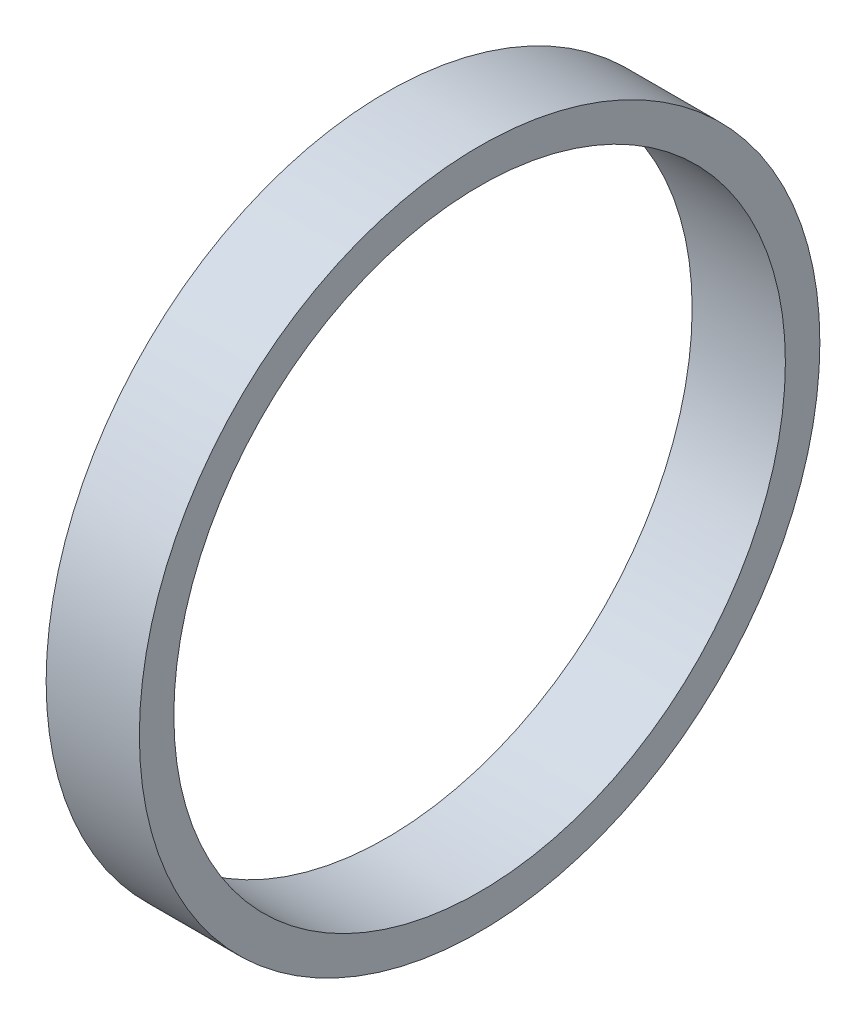
ISO-10303-21;
HEADER;
FILE_DESCRIPTION(('STEP AP214'),'2;1');
FILE_NAME('part.step','',(''),(''),'','','');
FILE_SCHEMA(('AUTOMOTIVE_DESIGN { 1 0 10303 214 1 1 1 1 }'));
ENDSEC;
DATA;
#1=APPLICATION_CONTEXT('core data for automotive mechanical design processes');
#2=APPLICATION_PROTOCOL_DEFINITION('international standard','automotive_design',2000,#1);
#3=PRODUCT_CONTEXT('',#1,'mechanical');
#4=PRODUCT('Part','Part','',(#3));
#5=PRODUCT_RELATED_PRODUCT_CATEGORY('part','',(#4));
#6=PRODUCT_DEFINITION_FORMATION('','',#4);
#7=PRODUCT_DEFINITION_CONTEXT('part definition',#1,'design');
#8=PRODUCT_DEFINITION('design','',#6,#7);
#9=PRODUCT_DEFINITION_SHAPE('','',#8);
#10=(LENGTH_UNIT() NAMED_UNIT(*) SI_UNIT(.MILLI.,.METRE.));
#11=(NAMED_UNIT(*) PLANE_ANGLE_UNIT() SI_UNIT($,.RADIAN.));
#12=(NAMED_UNIT(*) SI_UNIT($,.STERADIAN.) SOLID_ANGLE_UNIT());
#13=UNCERTAINTY_MEASURE_WITH_UNIT(LENGTH_MEASURE(1.E-05),#10,'distance_accuracy_value','');
#14=(GEOMETRIC_REPRESENTATION_CONTEXT(3) GLOBAL_UNCERTAINTY_ASSIGNED_CONTEXT((#13)) GLOBAL_UNIT_ASSIGNED_CONTEXT((#10,
#11,#12)) REPRESENTATION_CONTEXT('',''));
#15=CARTESIAN_POINT('',(0.,0.,0.));
#16=DIRECTION('',(0.,0.,1.));
#17=DIRECTION('',(1.,0.,0.));
#18=AXIS2_PLACEMENT_3D('',#15,#16,#17);
#19=CARTESIAN_POINT('',(168.,98.4132653061225,0.));
#20=DIRECTION('',(-1.,0.,0.));
#21=DIRECTION('',(0.,0.,1.));
#22=AXIS2_PLACEMENT_3D('',#19,#20,#21);
#23=PLANE('',#22);
#24=CARTESIAN_POINT('',(168.,98.4132653061225,0.));
#25=DIRECTION('',(-1.,0.,0.));
#26=DIRECTION('',(0.,0.,1.));
#27=AXIS2_PLACEMENT_3D('',#24,#25,#26);
#28=CIRCLE('',#27,36.5);
#29=CARTESIAN_POINT('',(168.,98.4132653061225,36.5));
#30=VERTEX_POINT('',#29);
#31=EDGE_CURVE('E37',#30,#30,#28,.T.);
#32=ORIENTED_EDGE('',*,*,#31,.F.);
#33=EDGE_LOOP('',(#32));
#34=FACE_BOUND('',#33,.T.);
#35=CARTESIAN_POINT('',(168.,98.4132653061225,0.));
#36=DIRECTION('',(-1.,0.,0.));
#37=DIRECTION('',(0.,0.,1.));
#38=AXIS2_PLACEMENT_3D('',#35,#36,#37);
#39=CIRCLE('',#38,32.8);
#40=CARTESIAN_POINT('',(168.,98.4132653061225,32.8));
#41=VERTEX_POINT('',#40);
#42=EDGE_CURVE('E46',#41,#41,#39,.T.);
#43=ORIENTED_EDGE('',*,*,#42,.T.);
#44=EDGE_LOOP('',(#43));
#45=FACE_BOUND('',#44,.T.);
#46=ADVANCED_FACE('F30',(#34,#45),#23,.F.);
#47=CARTESIAN_POINT('',(54.762409946764,98.4132653061225,0.));
#48=DIRECTION('',(1.,0.,0.));
#49=DIRECTION('',(0.,0.,-1.));
#50=AXIS2_PLACEMENT_3D('',#47,#48,#49);
#51=CYLINDRICAL_SURFACE('',#50,36.5);
#52=CARTESIAN_POINT('',(158.,98.4132653061225,0.));
#53=DIRECTION('',(1.,0.,0.));
#54=DIRECTION('',(0.,0.,-1.));
#55=AXIS2_PLACEMENT_3D('',#52,#53,#54);
#56=CIRCLE('',#55,36.5);
#57=CARTESIAN_POINT('',(158.,98.4132653061225,-36.5));
#58=VERTEX_POINT('',#57);
#59=EDGE_CURVE('E41',#58,#58,#56,.T.);
#60=ORIENTED_EDGE('',*,*,#59,.T.);
#61=EDGE_LOOP('',(#60));
#62=FACE_BOUND('',#61,.T.);
#63=ORIENTED_EDGE('',*,*,#31,.T.);
#64=EDGE_LOOP('',(#63));
#65=FACE_BOUND('',#64,.T.);
#66=ADVANCED_FACE('F54',(#62,#65),#51,.T.);
#67=CARTESIAN_POINT('',(54.762409946764,98.4132653061225,0.));
#68=DIRECTION('',(1.,0.,0.));
#69=DIRECTION('',(0.,0.,-1.));
#70=AXIS2_PLACEMENT_3D('',#67,#68,#69);
#71=CYLINDRICAL_SURFACE('',#70,32.8);
#72=CARTESIAN_POINT('',(158.,98.4132653061225,0.));
#73=DIRECTION('',(1.,0.,0.));
#74=DIRECTION('',(0.,0.,-1.));
#75=AXIS2_PLACEMENT_3D('',#72,#73,#74);
#76=CIRCLE('',#75,32.8);
#77=CARTESIAN_POINT('',(158.,98.4132653061225,-32.8));
#78=VERTEX_POINT('',#77);
#79=EDGE_CURVE('E10',#78,#78,#76,.T.);
#80=ORIENTED_EDGE('',*,*,#79,.F.);
#81=EDGE_LOOP('',(#80));
#82=FACE_BOUND('',#81,.T.);
#83=ORIENTED_EDGE('',*,*,#42,.F.);
#84=EDGE_LOOP('',(#83));
#85=FACE_BOUND('',#84,.T.);
#86=ADVANCED_FACE('F52',(#82,#85),#71,.F.);
#87=CARTESIAN_POINT('',(158.,98.4132653061225,0.));
#88=DIRECTION('',(1.,0.,0.));
#89=DIRECTION('',(0.,0.,-1.));
#90=AXIS2_PLACEMENT_3D('',#87,#88,#89);
#91=PLANE('',#90);
#92=ORIENTED_EDGE('',*,*,#79,.T.);
#93=EDGE_LOOP('',(#92));
#94=FACE_BOUND('',#93,.T.);
#95=ORIENTED_EDGE('',*,*,#59,.F.);
#96=EDGE_LOOP('',(#95));
#97=FACE_BOUND('',#96,.T.);
#98=ADVANCED_FACE('F32',(#94,#97),#91,.F.);
#99=CLOSED_SHELL('',(#46,#66,#86,#98));
#100=MANIFOLD_SOLID_BREP('B2',#99);
#101=ADVANCED_BREP_SHAPE_REPRESENTATION('',(#18,#100),#14);
#102=SHAPE_DEFINITION_REPRESENTATION(#9,#101);
ENDSEC;
END-ISO-10303-21;
